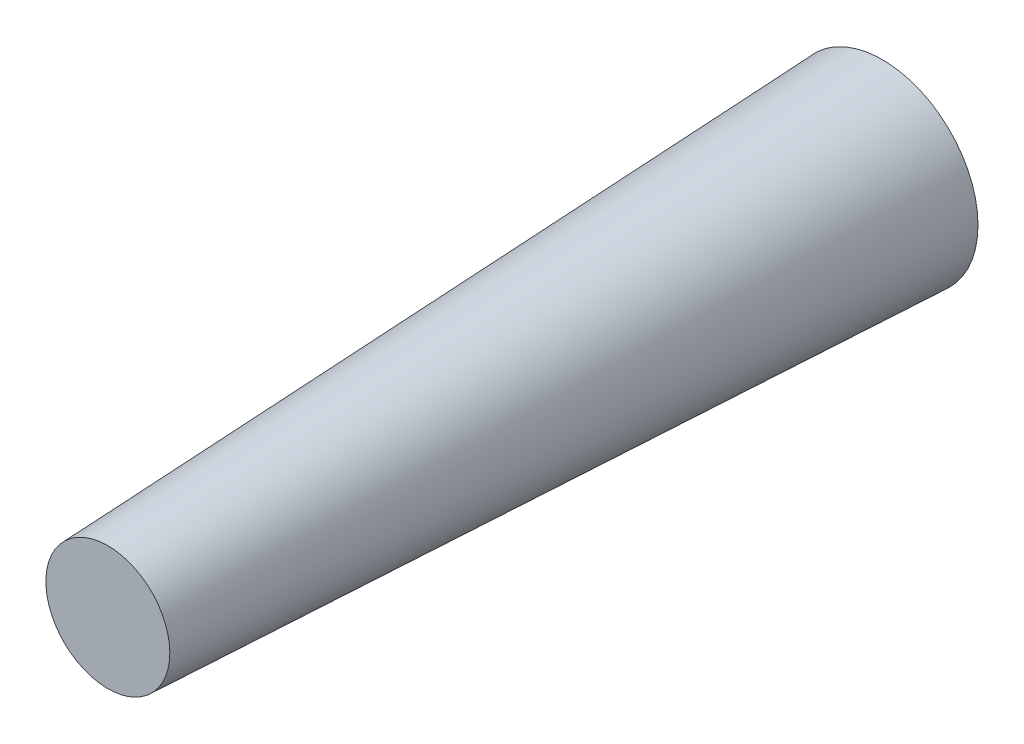
ISO-10303-21;
HEADER;
FILE_DESCRIPTION(('STEP AP214'),'2;1');
FILE_NAME('part.step','',(''),(''),'','','');
FILE_SCHEMA(('AUTOMOTIVE_DESIGN { 1 0 10303 214 1 1 1 1 }'));
ENDSEC;
DATA;
#1=APPLICATION_CONTEXT('core data for automotive mechanical design processes');
#2=APPLICATION_PROTOCOL_DEFINITION('international standard','automotive_design',2000,#1);
#3=PRODUCT_CONTEXT('',#1,'mechanical');
#4=PRODUCT('Part','Part','',(#3));
#5=PRODUCT_RELATED_PRODUCT_CATEGORY('part','',(#4));
#6=PRODUCT_DEFINITION_FORMATION('','',#4);
#7=PRODUCT_DEFINITION_CONTEXT('part definition',#1,'design');
#8=PRODUCT_DEFINITION('design','',#6,#7);
#9=PRODUCT_DEFINITION_SHAPE('','',#8);
#10=(LENGTH_UNIT() NAMED_UNIT(*) SI_UNIT(.MILLI.,.METRE.));
#11=(NAMED_UNIT(*) PLANE_ANGLE_UNIT() SI_UNIT($,.RADIAN.));
#12=(NAMED_UNIT(*) SI_UNIT($,.STERADIAN.) SOLID_ANGLE_UNIT());
#13=UNCERTAINTY_MEASURE_WITH_UNIT(LENGTH_MEASURE(1.E-05),#10,'distance_accuracy_value','');
#14=(GEOMETRIC_REPRESENTATION_CONTEXT(3) GLOBAL_UNCERTAINTY_ASSIGNED_CONTEXT((#13)) GLOBAL_UNIT_ASSIGNED_CONTEXT((#10,
#11,#12)) REPRESENTATION_CONTEXT('',''));
#15=CARTESIAN_POINT('',(0.,0.,0.));
#16=DIRECTION('',(0.,0.,1.));
#17=DIRECTION('',(1.,0.,0.));
#18=AXIS2_PLACEMENT_3D('',#15,#16,#17);
#19=CARTESIAN_POINT('',(0.,0.,150.));
#20=DIRECTION('',(0.,0.,1.));
#21=DIRECTION('',(1.,0.,0.));
#22=AXIS2_PLACEMENT_3D('',#19,#20,#21);
#23=PLANE('',#22);
#24=CARTESIAN_POINT('',(0.,0.,150.));
#25=DIRECTION('',(0.,0.,1.));
#26=DIRECTION('',(1.,0.,0.));
#27=AXIS2_PLACEMENT_3D('',#24,#25,#26);
#28=CIRCLE('',#27,12.);
#29=CARTESIAN_POINT('',(12.,0.,150.));
#30=VERTEX_POINT('',#29);
#31=EDGE_CURVE('E11',#30,#30,#28,.T.);
#32=ORIENTED_EDGE('',*,*,#31,.T.);
#33=EDGE_LOOP('',(#32));
#34=FACE_BOUND('',#33,.T.);
#35=ADVANCED_FACE('F41',(#34),#23,.T.);
#36=CARTESIAN_POINT('',(0.,0.,0.));
#37=DIRECTION('',(0.,0.,1.));
#38=DIRECTION('',(1.,0.,0.));
#39=AXIS2_PLACEMENT_3D('',#36,#37,#38);
#40=PLANE('',#39);
#41=CARTESIAN_POINT('',(0.,0.,0.));
#42=DIRECTION('',(0.,0.,1.));
#43=DIRECTION('',(1.,0.,0.));
#44=AXIS2_PLACEMENT_3D('',#41,#42,#43);
#45=CIRCLE('',#44,18.5);
#46=CARTESIAN_POINT('',(18.5,0.,0.));
#47=VERTEX_POINT('',#46);
#48=EDGE_CURVE('E50',#47,#47,#45,.T.);
#49=ORIENTED_EDGE('',*,*,#48,.F.);
#50=EDGE_LOOP('',(#49));
#51=FACE_BOUND('',#50,.T.);
#52=ADVANCED_FACE('F74',(#51),#40,.F.);
#53=CARTESIAN_POINT('',(0.,0.,150.));
#54=DIRECTION('',(0.,0.,-1.));
#55=DIRECTION('',(-1.,0.,0.));
#56=AXIS2_PLACEMENT_3D('',#53,#54,#55);
#57=CONICAL_SURFACE('',#56,12.,0.0433062403947096);
#58=ORIENTED_EDGE('',*,*,#48,.T.);
#59=EDGE_LOOP('',(#58));
#60=FACE_BOUND('',#59,.T.);
#61=ORIENTED_EDGE('',*,*,#31,.F.);
#62=EDGE_LOOP('',(#61));
#63=FACE_BOUND('',#62,.T.);
#64=ADVANCED_FACE('F82',(#60,#63),#57,.T.);
#65=CLOSED_SHELL('',(#35,#52,#64));
#66=MANIFOLD_SOLID_BREP('B2',#65);
#67=ADVANCED_BREP_SHAPE_REPRESENTATION('',(#18,#66),#14);
#68=SHAPE_DEFINITION_REPRESENTATION(#9,#67);
ENDSEC;
END-ISO-10303-21;
